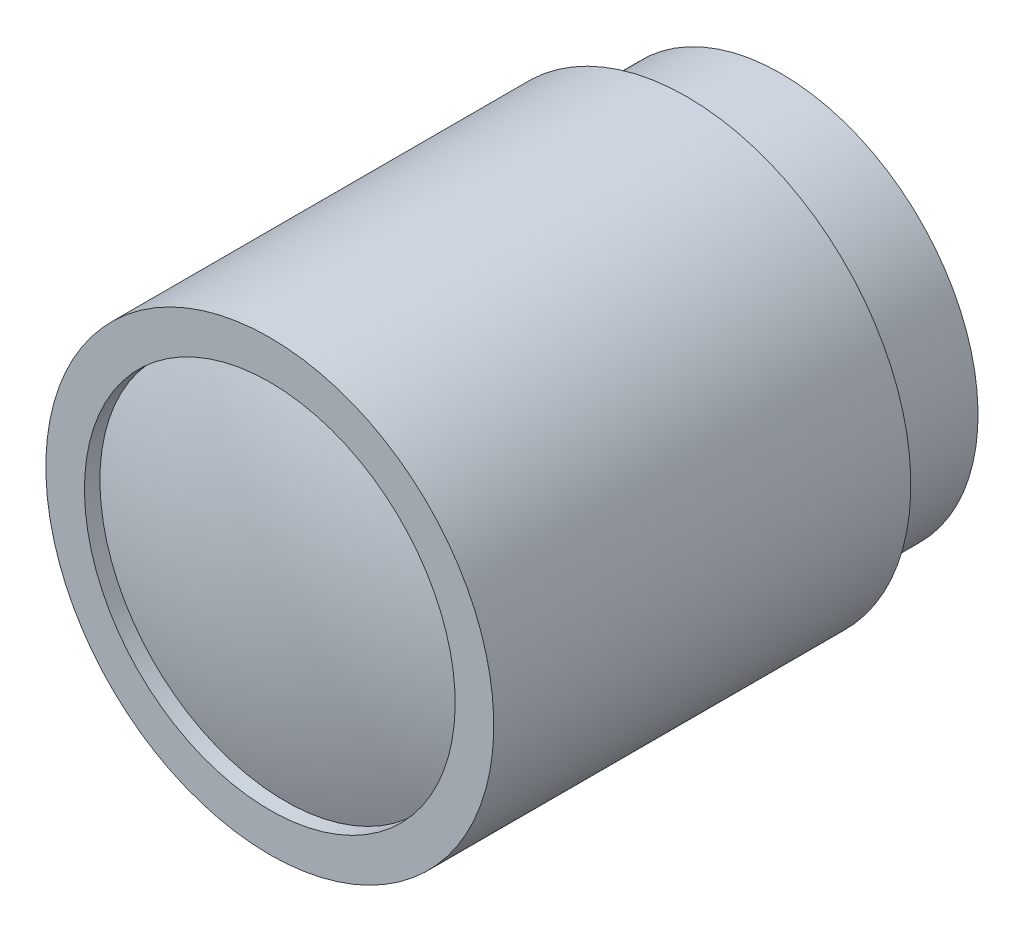
ISO-10303-21;
HEADER;
FILE_DESCRIPTION(('STEP AP214'),'2;1');
FILE_NAME('part.step','',(''),(''),'','','');
FILE_SCHEMA(('AUTOMOTIVE_DESIGN { 1 0 10303 214 1 1 1 1 }'));
ENDSEC;
DATA;
#1=APPLICATION_CONTEXT('core data for automotive mechanical design processes');
#2=APPLICATION_PROTOCOL_DEFINITION('international standard','automotive_design',2000,#1);
#3=PRODUCT_CONTEXT('',#1,'mechanical');
#4=PRODUCT('Part','Part','',(#3));
#5=PRODUCT_RELATED_PRODUCT_CATEGORY('part','',(#4));
#6=PRODUCT_DEFINITION_FORMATION('','',#4);
#7=PRODUCT_DEFINITION_CONTEXT('part definition',#1,'design');
#8=PRODUCT_DEFINITION('design','',#6,#7);
#9=PRODUCT_DEFINITION_SHAPE('','',#8);
#10=(LENGTH_UNIT() NAMED_UNIT(*) SI_UNIT(.MILLI.,.METRE.));
#11=(NAMED_UNIT(*) PLANE_ANGLE_UNIT() SI_UNIT($,.RADIAN.));
#12=(NAMED_UNIT(*) SI_UNIT($,.STERADIAN.) SOLID_ANGLE_UNIT());
#13=UNCERTAINTY_MEASURE_WITH_UNIT(LENGTH_MEASURE(1.E-05),#10,'distance_accuracy_value','');
#14=(GEOMETRIC_REPRESENTATION_CONTEXT(3) GLOBAL_UNCERTAINTY_ASSIGNED_CONTEXT((#13)) GLOBAL_UNIT_ASSIGNED_CONTEXT((#10,
#11,#12)) REPRESENTATION_CONTEXT('',''));
#15=CARTESIAN_POINT('',(0.,0.,0.));
#16=DIRECTION('',(0.,0.,1.));
#17=DIRECTION('',(1.,0.,0.));
#18=AXIS2_PLACEMENT_3D('',#15,#16,#17);
#19=CARTESIAN_POINT('',(0.,14.,15.));
#20=DIRECTION('',(0.,0.,1.));
#21=DIRECTION('',(0.,-1.,0.));
#22=AXIS2_PLACEMENT_3D('',#19,#20,#21);
#23=PLANE('',#22);
#24=CARTESIAN_POINT('',(0.,0.,15.));
#25=DIRECTION('',(0.,0.,-1.));
#26=DIRECTION('',(0.,1.,0.));
#27=AXIS2_PLACEMENT_3D('',#24,#25,#26);
#28=CIRCLE('',#27,12.);
#29=CARTESIAN_POINT('',(0.,12.,15.));
#30=VERTEX_POINT('',#29);
#31=EDGE_CURVE('E10',#30,#30,#28,.T.);
#32=ORIENTED_EDGE('',*,*,#31,.T.);
#33=EDGE_LOOP('',(#32));
#34=FACE_BOUND('',#33,.T.);
#35=CARTESIAN_POINT('',(0.,0.,15.));
#36=DIRECTION('',(0.,0.,-1.));
#37=DIRECTION('',(0.,1.,0.));
#38=AXIS2_PLACEMENT_3D('',#35,#36,#37);
#39=CIRCLE('',#38,14.5);
#40=CARTESIAN_POINT('',(0.,14.5,15.));
#41=VERTEX_POINT('',#40);
#42=EDGE_CURVE('E59',#41,#41,#39,.T.);
#43=ORIENTED_EDGE('',*,*,#42,.F.);
#44=EDGE_LOOP('',(#43));
#45=FACE_BOUND('',#44,.T.);
#46=ADVANCED_FACE('F37',(#34,#45),#23,.T.);
#47=CARTESIAN_POINT('',(0.,0.,-18.1));
#48=DIRECTION('',(0.,0.,-1.));
#49=DIRECTION('',(0.,1.,0.));
#50=AXIS2_PLACEMENT_3D('',#47,#48,#49);
#51=CYLINDRICAL_SURFACE('',#50,12.);
#52=CARTESIAN_POINT('',(0.,0.,14.));
#53=DIRECTION('',(0.,0.,-1.));
#54=DIRECTION('',(0.,1.,0.));
#55=AXIS2_PLACEMENT_3D('',#52,#53,#54);
#56=CIRCLE('',#55,12.);
#57=CARTESIAN_POINT('',(0.,12.,14.));
#58=VERTEX_POINT('',#57);
#59=EDGE_CURVE('E43',#58,#58,#56,.T.);
#60=ORIENTED_EDGE('',*,*,#59,.T.);
#61=EDGE_LOOP('',(#60));
#62=FACE_BOUND('',#61,.T.);
#63=ORIENTED_EDGE('',*,*,#31,.F.);
#64=EDGE_LOOP('',(#63));
#65=FACE_BOUND('',#64,.T.);
#66=ADVANCED_FACE('F67',(#62,#65),#51,.F.);
#67=CARTESIAN_POINT('',(0.,0.,-21.));
#68=DIRECTION('',(0.,0.,-1.));
#69=DIRECTION('',(0.,1.,0.));
#70=AXIS2_PLACEMENT_3D('',#67,#68,#69);
#71=SPHERICAL_SURFACE('',#70,37.);
#72=ORIENTED_EDGE('',*,*,#59,.F.);
#73=EDGE_LOOP('',(#72));
#74=FACE_BOUND('',#73,.T.);
#75=ADVANCED_FACE('F71',(#74),#71,.T.);
#76=CARTESIAN_POINT('',(0.,12.75,-18.1));
#77=DIRECTION('',(0.,0.,-1.));
#78=DIRECTION('',(0.,1.,0.));
#79=AXIS2_PLACEMENT_3D('',#76,#77,#78);
#80=PLANE('',#79);
#81=CARTESIAN_POINT('',(0.,0.,-18.1));
#82=DIRECTION('',(0.,0.,-1.));
#83=DIRECTION('',(0.,1.,0.));
#84=AXIS2_PLACEMENT_3D('',#81,#82,#83);
#85=CIRCLE('',#84,12.75);
#86=CARTESIAN_POINT('',(0.,12.75,-18.1));
#87=VERTEX_POINT('',#86);
#88=EDGE_CURVE('E47',#87,#87,#85,.T.);
#89=ORIENTED_EDGE('',*,*,#88,.T.);
#90=EDGE_LOOP('',(#89));
#91=FACE_BOUND('',#90,.T.);
#92=ADVANCED_FACE('F75',(#91),#80,.T.);
#93=CARTESIAN_POINT('',(0.,0.,-18.1));
#94=DIRECTION('',(0.,0.,-1.));
#95=DIRECTION('',(0.,1.,0.));
#96=AXIS2_PLACEMENT_3D('',#93,#94,#95);
#97=CYLINDRICAL_SURFACE('',#96,12.75);
#98=CARTESIAN_POINT('',(0.,0.,-12.));
#99=DIRECTION('',(0.,0.,-1.));
#100=DIRECTION('',(0.,1.,0.));
#101=AXIS2_PLACEMENT_3D('',#98,#99,#100);
#102=CIRCLE('',#101,12.75);
#103=CARTESIAN_POINT('',(0.,12.75,-12.));
#104=VERTEX_POINT('',#103);
#105=EDGE_CURVE('E51',#104,#104,#102,.T.);
#106=ORIENTED_EDGE('',*,*,#105,.T.);
#107=EDGE_LOOP('',(#106));
#108=FACE_BOUND('',#107,.T.);
#109=ORIENTED_EDGE('',*,*,#88,.F.);
#110=EDGE_LOOP('',(#109));
#111=FACE_BOUND('',#110,.T.);
#112=ADVANCED_FACE('F82',(#108,#111),#97,.T.);
#113=CARTESIAN_POINT('',(0.,14.5,-12.));
#114=DIRECTION('',(0.,0.,-1.));
#115=DIRECTION('',(0.,1.,0.));
#116=AXIS2_PLACEMENT_3D('',#113,#114,#115);
#117=PLANE('',#116);
#118=CARTESIAN_POINT('',(0.,0.,-12.));
#119=DIRECTION('',(0.,0.,-1.));
#120=DIRECTION('',(0.,1.,0.));
#121=AXIS2_PLACEMENT_3D('',#118,#119,#120);
#122=CIRCLE('',#121,14.5);
#123=CARTESIAN_POINT('',(0.,14.5,-12.));
#124=VERTEX_POINT('',#123);
#125=EDGE_CURVE('E56',#124,#124,#122,.T.);
#126=ORIENTED_EDGE('',*,*,#125,.T.);
#127=EDGE_LOOP('',(#126));
#128=FACE_BOUND('',#127,.T.);
#129=ORIENTED_EDGE('',*,*,#105,.F.);
#130=EDGE_LOOP('',(#129));
#131=FACE_BOUND('',#130,.T.);
#132=ADVANCED_FACE('F86',(#128,#131),#117,.T.);
#133=CARTESIAN_POINT('',(0.,0.,-18.1));
#134=DIRECTION('',(0.,0.,-1.));
#135=DIRECTION('',(0.,1.,0.));
#136=AXIS2_PLACEMENT_3D('',#133,#134,#135);
#137=CYLINDRICAL_SURFACE('',#136,14.5);
#138=ORIENTED_EDGE('',*,*,#42,.T.);
#139=EDGE_LOOP('',(#138));
#140=FACE_BOUND('',#139,.T.);
#141=ORIENTED_EDGE('',*,*,#125,.F.);
#142=EDGE_LOOP('',(#141));
#143=FACE_BOUND('',#142,.T.);
#144=ADVANCED_FACE('F63',(#140,#143),#137,.T.);
#145=CLOSED_SHELL('',(#46,#66,#75,#92,#112,#132,#144));
#146=MANIFOLD_SOLID_BREP('B2',#145);
#147=ADVANCED_BREP_SHAPE_REPRESENTATION('',(#18,#146),#14);
#148=SHAPE_DEFINITION_REPRESENTATION(#9,#147);
ENDSEC;
END-ISO-10303-21;
